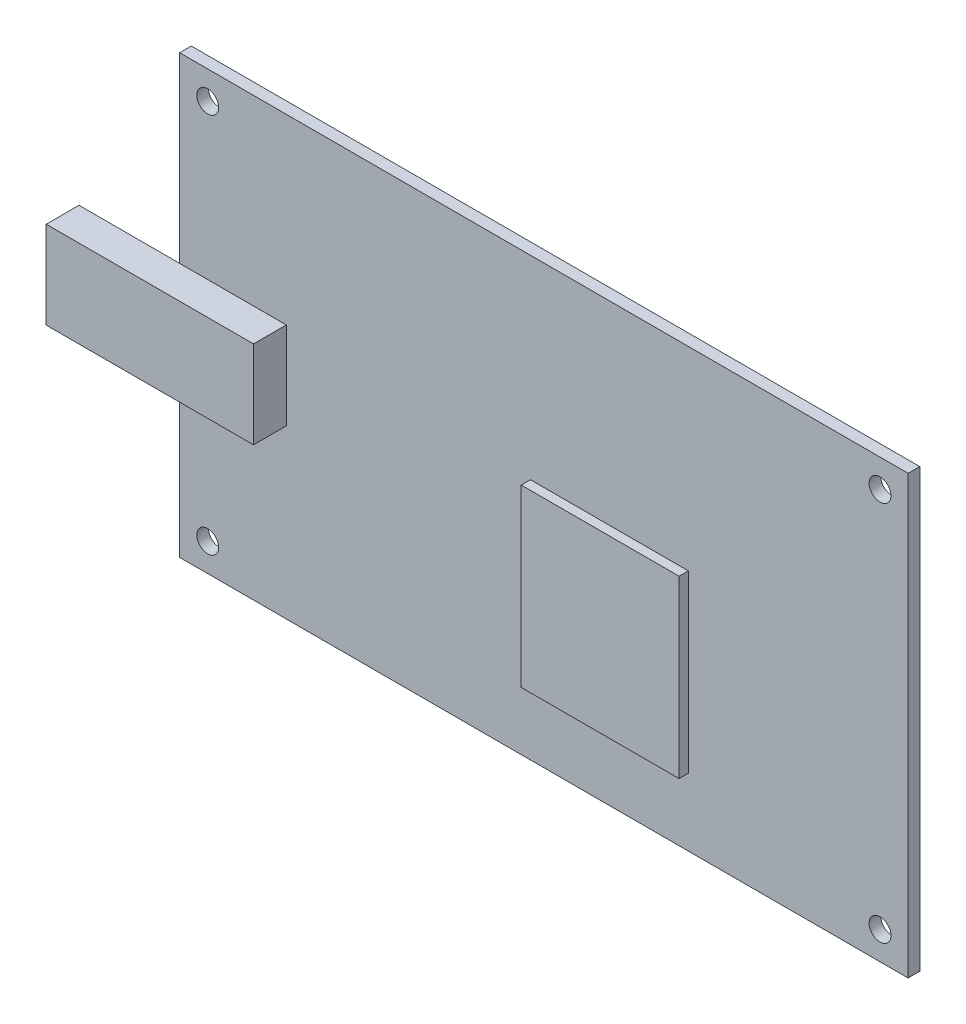
ISO-10303-21;
HEADER;
FILE_DESCRIPTION(('STEP AP214'),'2;1');
FILE_NAME('part.step','',(''),(''),'','','');
FILE_SCHEMA(('AUTOMOTIVE_DESIGN { 1 0 10303 214 1 1 1 1 }'));
ENDSEC;
DATA;
#1=APPLICATION_CONTEXT('core data for automotive mechanical design processes');
#2=APPLICATION_PROTOCOL_DEFINITION('international standard','automotive_design',2000,#1);
#3=PRODUCT_CONTEXT('',#1,'mechanical');
#4=PRODUCT('Part','Part','',(#3));
#5=PRODUCT_RELATED_PRODUCT_CATEGORY('part','',(#4));
#6=PRODUCT_DEFINITION_FORMATION('','',#4);
#7=PRODUCT_DEFINITION_CONTEXT('part definition',#1,'design');
#8=PRODUCT_DEFINITION('design','',#6,#7);
#9=PRODUCT_DEFINITION_SHAPE('','',#8);
#10=(LENGTH_UNIT() NAMED_UNIT(*) SI_UNIT(.MILLI.,.METRE.));
#11=(NAMED_UNIT(*) PLANE_ANGLE_UNIT() SI_UNIT($,.RADIAN.));
#12=(NAMED_UNIT(*) SI_UNIT($,.STERADIAN.) SOLID_ANGLE_UNIT());
#13=UNCERTAINTY_MEASURE_WITH_UNIT(LENGTH_MEASURE(1.E-05),#10,'distance_accuracy_value','');
#14=(GEOMETRIC_REPRESENTATION_CONTEXT(3) GLOBAL_UNCERTAINTY_ASSIGNED_CONTEXT((#13)) GLOBAL_UNIT_ASSIGNED_CONTEXT((#10,
#11,#12)) REPRESENTATION_CONTEXT('',''));
#15=CARTESIAN_POINT('',(0.,0.,0.));
#16=DIRECTION('',(0.,0.,1.));
#17=DIRECTION('',(1.,0.,0.));
#18=AXIS2_PLACEMENT_3D('',#15,#16,#17);
#19=CARTESIAN_POINT('',(0.,0.,1.6));
#20=DIRECTION('',(0.,0.,-1.));
#21=DIRECTION('',(-1.,0.,0.));
#22=AXIS2_PLACEMENT_3D('',#19,#20,#21);
#23=PLANE('',#22);
#24=CARTESIAN_POINT('',(-46.15,-26.15,1.6));
#25=DIRECTION('',(0.,0.,1.));
#26=DIRECTION('',(1.,0.,0.));
#27=AXIS2_PLACEMENT_3D('',#24,#25,#26);
#28=CIRCLE('',#27,1.5);
#29=CARTESIAN_POINT('',(-44.65,-26.15,1.6));
#30=VERTEX_POINT('',#29);
#31=EDGE_CURVE('E439',#30,#30,#28,.T.);
#32=ORIENTED_EDGE('',*,*,#31,.F.);
#33=EDGE_LOOP('',(#32));
#34=FACE_BOUND('',#33,.T.);
#35=CARTESIAN_POINT('',(-46.15,26.15,1.6));
#36=DIRECTION('',(0.,0.,1.));
#37=DIRECTION('',(1.,0.,0.));
#38=AXIS2_PLACEMENT_3D('',#35,#36,#37);
#39=CIRCLE('',#38,1.5);
#40=CARTESIAN_POINT('',(-44.65,26.15,1.6));
#41=VERTEX_POINT('',#40);
#42=EDGE_CURVE('E441',#41,#41,#39,.T.);
#43=ORIENTED_EDGE('',*,*,#42,.F.);
#44=EDGE_LOOP('',(#43));
#45=FACE_BOUND('',#44,.T.);
#46=CARTESIAN_POINT('',(46.15,-26.15,1.6));
#47=DIRECTION('',(0.,0.,1.));
#48=DIRECTION('',(1.,0.,0.));
#49=AXIS2_PLACEMENT_3D('',#46,#47,#48);
#50=CIRCLE('',#49,1.5);
#51=CARTESIAN_POINT('',(47.65,-26.15,1.6));
#52=VERTEX_POINT('',#51);
#53=EDGE_CURVE('E449',#52,#52,#50,.T.);
#54=ORIENTED_EDGE('',*,*,#53,.F.);
#55=EDGE_LOOP('',(#54));
#56=FACE_BOUND('',#55,.T.);
#57=CARTESIAN_POINT('',(46.15,26.15,1.6));
#58=DIRECTION('',(0.,0.,1.));
#59=DIRECTION('',(1.,0.,0.));
#60=AXIS2_PLACEMENT_3D('',#57,#58,#59);
#61=CIRCLE('',#60,1.5);
#62=CARTESIAN_POINT('',(47.65,26.15,1.6));
#63=VERTEX_POINT('',#62);
#64=EDGE_CURVE('E455',#63,#63,#61,.T.);
#65=ORIENTED_EDGE('',*,*,#64,.F.);
#66=EDGE_LOOP('',(#65));
#67=FACE_BOUND('',#66,.T.);
#68=DIRECTION('',(-1.,0.,0.));
#69=VECTOR('',#68,1.);
#70=CARTESIAN_POINT('',(-35.3638980427604,4.95599999999999,1.6));
#71=LINE('',#70,#69);
#72=CARTESIAN_POINT('',(-35.3638980427604,4.95599999999999,1.6));
#73=VERTEX_POINT('',#72);
#74=CARTESIAN_POINT('',(-50.,4.95599999999999,1.6));
#75=VERTEX_POINT('',#74);
#76=EDGE_CURVE('E167',#73,#75,#71,.T.);
#77=ORIENTED_EDGE('',*,*,#76,.F.);
#78=DIRECTION('',(0.,1.,0.));
#79=VECTOR('',#78,1.);
#80=CARTESIAN_POINT('',(-35.3638980427604,4.95599999999999,1.6));
#81=LINE('',#80,#79);
#82=CARTESIAN_POINT('',(-35.3638980427604,-7.04400000000001,1.6));
#83=VERTEX_POINT('',#82);
#84=EDGE_CURVE('E175',#83,#73,#81,.T.);
#85=ORIENTED_EDGE('',*,*,#84,.F.);
#86=DIRECTION('',(1.,0.,0.));
#87=VECTOR('',#86,1.);
#88=CARTESIAN_POINT('',(-35.3638980427604,-7.04400000000001,1.6));
#89=LINE('',#88,#87);
#90=CARTESIAN_POINT('',(-50.,-7.04400000000001,1.6));
#91=VERTEX_POINT('',#90);
#92=EDGE_CURVE('E11',#91,#83,#89,.T.);
#93=ORIENTED_EDGE('',*,*,#92,.F.);
#94=DIRECTION('',(0.,-1.,0.));
#95=VECTOR('',#94,1.);
#96=CARTESIAN_POINT('',(-50.,30.,1.6));
#97=LINE('',#96,#95);
#98=CARTESIAN_POINT('',(-50.,-30.,1.6));
#99=VERTEX_POINT('',#98);
#100=EDGE_CURVE('E200',#91,#99,#97,.T.);
#101=ORIENTED_EDGE('',*,*,#100,.T.);
#102=DIRECTION('',(-1.,0.,0.));
#103=VECTOR('',#102,1.);
#104=CARTESIAN_POINT('',(50.,-30.,1.6));
#105=LINE('',#104,#103);
#106=CARTESIAN_POINT('',(50.,-30.,1.6));
#107=VERTEX_POINT('',#106);
#108=EDGE_CURVE('E196',#107,#99,#105,.T.);
#109=ORIENTED_EDGE('',*,*,#108,.F.);
#110=DIRECTION('',(0.,-1.,0.));
#111=VECTOR('',#110,1.);
#112=CARTESIAN_POINT('',(50.,30.,1.6));
#113=LINE('',#112,#111);
#114=CARTESIAN_POINT('',(50.,30.,1.6));
#115=VERTEX_POINT('',#114);
#116=EDGE_CURVE('E193',#115,#107,#113,.T.);
#117=ORIENTED_EDGE('',*,*,#116,.F.);
#118=DIRECTION('',(-1.,0.,0.));
#119=VECTOR('',#118,1.);
#120=CARTESIAN_POINT('',(50.,30.,1.6));
#121=LINE('',#120,#119);
#122=CARTESIAN_POINT('',(-50.,30.,1.6));
#123=VERTEX_POINT('',#122);
#124=EDGE_CURVE('E204',#115,#123,#121,.T.);
#125=ORIENTED_EDGE('',*,*,#124,.T.);
#126=EDGE_CURVE('E201',#123,#75,#97,.T.);
#127=ORIENTED_EDGE('',*,*,#126,.T.);
#128=EDGE_LOOP('',(#77,#85,#93,#101,#109,#117,#125,#127));
#129=FACE_BOUND('',#128,.T.);
#130=DIRECTION('',(0.,-1.,0.));
#131=VECTOR('',#130,1.);
#132=CARTESIAN_POINT('',(-1.84094965071324,-20.7416611248163,1.6));
#133=LINE('',#132,#131);
#134=CARTESIAN_POINT('',(-1.84094965071324,3.31803456435864,1.6));
#135=VERTEX_POINT('',#134);
#136=CARTESIAN_POINT('',(-1.84094965071324,-20.7416611248163,1.6));
#137=VERTEX_POINT('',#136);
#138=EDGE_CURVE('E154',#135,#137,#133,.T.);
#139=ORIENTED_EDGE('',*,*,#138,.F.);
#140=DIRECTION('',(-1.,0.,0.));
#141=VECTOR('',#140,1.);
#142=CARTESIAN_POINT('',(19.8270936427463,3.31803456435864,1.6));
#143=LINE('',#142,#141);
#144=CARTESIAN_POINT('',(19.8270936427463,3.31803456435864,1.6));
#145=VERTEX_POINT('',#144);
#146=EDGE_CURVE('E151',#145,#135,#143,.T.);
#147=ORIENTED_EDGE('',*,*,#146,.F.);
#148=DIRECTION('',(0.,1.,0.));
#149=VECTOR('',#148,1.);
#150=CARTESIAN_POINT('',(19.8270936427463,-20.7416611248163,1.6));
#151=LINE('',#150,#149);
#152=CARTESIAN_POINT('',(19.8270936427463,-20.7416611248163,1.6));
#153=VERTEX_POINT('',#152);
#154=EDGE_CURVE('E59',#153,#145,#151,.T.);
#155=ORIENTED_EDGE('',*,*,#154,.F.);
#156=DIRECTION('',(1.,0.,0.));
#157=VECTOR('',#156,1.);
#158=CARTESIAN_POINT('',(19.8270936427463,-20.7416611248163,1.6));
#159=LINE('',#158,#157);
#160=EDGE_CURVE('E54',#137,#153,#159,.T.);
#161=ORIENTED_EDGE('',*,*,#160,.F.);
#162=EDGE_LOOP('',(#139,#147,#155,#161));
#163=FACE_BOUND('',#162,.T.);
#164=ADVANCED_FACE('F36',(#34,#45,#56,#67,#129,#163),#23,.F.);
#165=CARTESIAN_POINT('',(50.,30.,1.6));
#166=DIRECTION('',(1.,0.,0.));
#167=DIRECTION('',(0.,0.,-1.));
#168=AXIS2_PLACEMENT_3D('',#165,#166,#167);
#169=PLANE('',#168);
#170=DIRECTION('',(0.,-1.,0.));
#171=VECTOR('',#170,1.);
#172=CARTESIAN_POINT('',(50.,30.,0.));
#173=LINE('',#172,#171);
#174=CARTESIAN_POINT('',(50.,30.,0.));
#175=VERTEX_POINT('',#174);
#176=CARTESIAN_POINT('',(50.,-30.,0.));
#177=VERTEX_POINT('',#176);
#178=EDGE_CURVE('E192',#175,#177,#173,.T.);
#179=ORIENTED_EDGE('',*,*,#178,.F.);
#180=DIRECTION('',(0.,0.,-1.));
#181=VECTOR('',#180,1.);
#182=CARTESIAN_POINT('',(50.,30.,1.6));
#183=LINE('',#182,#181);
#184=EDGE_CURVE('E45',#115,#175,#183,.T.);
#185=ORIENTED_EDGE('',*,*,#184,.F.);
#186=ORIENTED_EDGE('',*,*,#116,.T.);
#187=DIRECTION('',(0.,0.,-1.));
#188=VECTOR('',#187,1.);
#189=CARTESIAN_POINT('',(50.,-30.,1.6));
#190=LINE('',#189,#188);
#191=EDGE_CURVE('E40',#107,#177,#190,.T.);
#192=ORIENTED_EDGE('',*,*,#191,.T.);
#193=EDGE_LOOP('',(#179,#185,#186,#192));
#194=FACE_BOUND('',#193,.T.);
#195=ADVANCED_FACE('F38',(#194),#169,.T.);
#196=CARTESIAN_POINT('',(50.,30.,1.6));
#197=DIRECTION('',(0.,-1.,0.));
#198=DIRECTION('',(1.,0.,0.));
#199=AXIS2_PLACEMENT_3D('',#196,#197,#198);
#200=PLANE('',#199);
#201=DIRECTION('',(-1.,0.,0.));
#202=VECTOR('',#201,1.);
#203=CARTESIAN_POINT('',(50.,30.,0.));
#204=LINE('',#203,#202);
#205=CARTESIAN_POINT('',(-50.,30.,0.));
#206=VERTEX_POINT('',#205);
#207=EDGE_CURVE('E197',#175,#206,#204,.T.);
#208=ORIENTED_EDGE('',*,*,#207,.T.);
#209=DIRECTION('',(0.,0.,-1.));
#210=VECTOR('',#209,1.);
#211=CARTESIAN_POINT('',(-50.,30.,1.6));
#212=LINE('',#211,#210);
#213=EDGE_CURVE('E217',#123,#206,#212,.T.);
#214=ORIENTED_EDGE('',*,*,#213,.F.);
#215=ORIENTED_EDGE('',*,*,#124,.F.);
#216=ORIENTED_EDGE('',*,*,#184,.T.);
#217=EDGE_LOOP('',(#208,#214,#215,#216));
#218=FACE_BOUND('',#217,.T.);
#219=ADVANCED_FACE('F234',(#218),#200,.F.);
#220=CARTESIAN_POINT('',(-50.,30.,1.6));
#221=DIRECTION('',(1.,0.,0.));
#222=DIRECTION('',(0.,0.,-1.));
#223=AXIS2_PLACEMENT_3D('',#220,#221,#222);
#224=PLANE('',#223);
#225=DIRECTION('',(0.,-1.,0.));
#226=VECTOR('',#225,1.);
#227=CARTESIAN_POINT('',(-50.,30.,0.));
#228=LINE('',#227,#226);
#229=CARTESIAN_POINT('',(-50.,-30.,0.));
#230=VERTEX_POINT('',#229);
#231=EDGE_CURVE('E212',#206,#230,#228,.T.);
#232=ORIENTED_EDGE('',*,*,#231,.T.);
#233=DIRECTION('',(0.,0.,-1.));
#234=VECTOR('',#233,1.);
#235=CARTESIAN_POINT('',(-50.,-30.,1.6));
#236=LINE('',#235,#234);
#237=EDGE_CURVE('E219',#99,#230,#236,.T.);
#238=ORIENTED_EDGE('',*,*,#237,.F.);
#239=ORIENTED_EDGE('',*,*,#100,.F.);
#240=EDGE_CURVE('E205',#75,#91,#97,.T.);
#241=ORIENTED_EDGE('',*,*,#240,.F.);
#242=ORIENTED_EDGE('',*,*,#126,.F.);
#243=ORIENTED_EDGE('',*,*,#213,.T.);
#244=EDGE_LOOP('',(#232,#238,#239,#241,#242,#243));
#245=FACE_BOUND('',#244,.T.);
#246=ADVANCED_FACE('F238',(#245),#224,.F.);
#247=CARTESIAN_POINT('',(50.,-30.,1.6));
#248=DIRECTION('',(0.,-1.,0.));
#249=DIRECTION('',(1.,0.,0.));
#250=AXIS2_PLACEMENT_3D('',#247,#248,#249);
#251=PLANE('',#250);
#252=DIRECTION('',(-1.,0.,0.));
#253=VECTOR('',#252,1.);
#254=CARTESIAN_POINT('',(50.,-30.,0.));
#255=LINE('',#254,#253);
#256=EDGE_CURVE('E209',#177,#230,#255,.T.);
#257=ORIENTED_EDGE('',*,*,#256,.F.);
#258=ORIENTED_EDGE('',*,*,#191,.F.);
#259=ORIENTED_EDGE('',*,*,#108,.T.);
#260=ORIENTED_EDGE('',*,*,#237,.T.);
#261=EDGE_LOOP('',(#257,#258,#259,#260));
#262=FACE_BOUND('',#261,.T.);
#263=ADVANCED_FACE('F227',(#262),#251,.T.);
#264=CARTESIAN_POINT('',(0.,0.,0.));
#265=DIRECTION('',(0.,0.,-1.));
#266=DIRECTION('',(-1.,0.,0.));
#267=AXIS2_PLACEMENT_3D('',#264,#265,#266);
#268=PLANE('',#267);
#269=CARTESIAN_POINT('',(-46.15,-26.15,0.));
#270=DIRECTION('',(0.,0.,-1.));
#271=DIRECTION('',(-1.,0.,0.));
#272=AXIS2_PLACEMENT_3D('',#269,#270,#271);
#273=CIRCLE('',#272,1.5);
#274=CARTESIAN_POINT('',(-47.65,-26.15,0.));
#275=VERTEX_POINT('',#274);
#276=EDGE_CURVE('E437',#275,#275,#273,.T.);
#277=ORIENTED_EDGE('',*,*,#276,.F.);
#278=EDGE_LOOP('',(#277));
#279=FACE_BOUND('',#278,.T.);
#280=CARTESIAN_POINT('',(-46.15,26.15,0.));
#281=DIRECTION('',(0.,0.,-1.));
#282=DIRECTION('',(-1.,0.,0.));
#283=AXIS2_PLACEMENT_3D('',#280,#281,#282);
#284=CIRCLE('',#283,1.5);
#285=CARTESIAN_POINT('',(-47.65,26.15,0.));
#286=VERTEX_POINT('',#285);
#287=EDGE_CURVE('E446',#286,#286,#284,.T.);
#288=ORIENTED_EDGE('',*,*,#287,.F.);
#289=EDGE_LOOP('',(#288));
#290=FACE_BOUND('',#289,.T.);
#291=CARTESIAN_POINT('',(46.15,-26.15,0.));
#292=DIRECTION('',(0.,0.,-1.));
#293=DIRECTION('',(-1.,0.,0.));
#294=AXIS2_PLACEMENT_3D('',#291,#292,#293);
#295=CIRCLE('',#294,1.5);
#296=CARTESIAN_POINT('',(44.65,-26.15,0.));
#297=VERTEX_POINT('',#296);
#298=EDGE_CURVE('E452',#297,#297,#295,.T.);
#299=ORIENTED_EDGE('',*,*,#298,.F.);
#300=EDGE_LOOP('',(#299));
#301=FACE_BOUND('',#300,.T.);
#302=CARTESIAN_POINT('',(46.15,26.15,0.));
#303=DIRECTION('',(0.,0.,-1.));
#304=DIRECTION('',(-1.,0.,0.));
#305=AXIS2_PLACEMENT_3D('',#302,#303,#304);
#306=CIRCLE('',#305,1.5);
#307=CARTESIAN_POINT('',(44.65,26.15,0.));
#308=VERTEX_POINT('',#307);
#309=EDGE_CURVE('E458',#308,#308,#306,.T.);
#310=ORIENTED_EDGE('',*,*,#309,.F.);
#311=EDGE_LOOP('',(#310));
#312=FACE_BOUND('',#311,.T.);
#313=ORIENTED_EDGE('',*,*,#178,.T.);
#314=ORIENTED_EDGE('',*,*,#256,.T.);
#315=ORIENTED_EDGE('',*,*,#231,.F.);
#316=ORIENTED_EDGE('',*,*,#207,.F.);
#317=EDGE_LOOP('',(#313,#314,#315,#316));
#318=FACE_BOUND('',#317,.T.);
#319=ADVANCED_FACE('F231',(#279,#290,#301,#312,#318),#268,.T.);
#320=CARTESIAN_POINT('',(-63.815805000047,4.95599999999999,6.1));
#321=DIRECTION('',(1.,0.,0.));
#322=DIRECTION('',(0.,0.,-1.));
#323=AXIS2_PLACEMENT_3D('',#320,#321,#322);
#324=PLANE('',#323);
#325=DIRECTION('',(0.,-1.,0.));
#326=VECTOR('',#325,1.);
#327=CARTESIAN_POINT('',(-63.815805000047,4.95599999999999,1.6));
#328=LINE('',#327,#326);
#329=CARTESIAN_POINT('',(-63.815805000047,4.95599999999999,1.6));
#330=VERTEX_POINT('',#329);
#331=CARTESIAN_POINT('',(-63.815805000047,-7.04400000000001,1.6));
#332=VERTEX_POINT('',#331);
#333=EDGE_CURVE('E155',#330,#332,#328,.T.);
#334=ORIENTED_EDGE('',*,*,#333,.T.);
#335=DIRECTION('',(0.,0.,-1.));
#336=VECTOR('',#335,1.);
#337=CARTESIAN_POINT('',(-63.815805000047,-7.04400000000001,6.1));
#338=LINE('',#337,#336);
#339=CARTESIAN_POINT('',(-63.815805000047,-7.04400000000001,6.1));
#340=VERTEX_POINT('',#339);
#341=EDGE_CURVE('E189',#340,#332,#338,.T.);
#342=ORIENTED_EDGE('',*,*,#341,.F.);
#343=DIRECTION('',(0.,-1.,0.));
#344=VECTOR('',#343,1.);
#345=CARTESIAN_POINT('',(-63.815805000047,4.95599999999999,6.1));
#346=LINE('',#345,#344);
#347=CARTESIAN_POINT('',(-63.815805000047,4.95599999999999,6.1));
#348=VERTEX_POINT('',#347);
#349=EDGE_CURVE('E163',#348,#340,#346,.T.);
#350=ORIENTED_EDGE('',*,*,#349,.F.);
#351=DIRECTION('',(0.,0.,-1.));
#352=VECTOR('',#351,1.);
#353=CARTESIAN_POINT('',(-63.815805000047,4.95599999999999,6.1));
#354=LINE('',#353,#352);
#355=EDGE_CURVE('E172',#348,#330,#354,.T.);
#356=ORIENTED_EDGE('',*,*,#355,.T.);
#357=EDGE_LOOP('',(#334,#342,#350,#356));
#358=FACE_BOUND('',#357,.T.);
#359=ADVANCED_FACE('F260',(#358),#324,.F.);
#360=CARTESIAN_POINT('',(-35.3638980427604,-7.04400000000001,6.1));
#361=DIRECTION('',(0.,1.,0.));
#362=DIRECTION('',(-1.,0.,0.));
#363=AXIS2_PLACEMENT_3D('',#360,#361,#362);
#364=PLANE('',#363);
#365=EDGE_CURVE('E47',#332,#91,#89,.T.);
#366=ORIENTED_EDGE('',*,*,#365,.T.);
#367=ORIENTED_EDGE('',*,*,#92,.T.);
#368=DIRECTION('',(0.,0.,-1.));
#369=VECTOR('',#368,1.);
#370=CARTESIAN_POINT('',(-35.3638980427604,-7.04400000000001,6.1));
#371=LINE('',#370,#369);
#372=CARTESIAN_POINT('',(-35.3638980427604,-7.04400000000001,6.1));
#373=VERTEX_POINT('',#372);
#374=EDGE_CURVE('E186',#373,#83,#371,.T.);
#375=ORIENTED_EDGE('',*,*,#374,.F.);
#376=DIRECTION('',(1.,0.,0.));
#377=VECTOR('',#376,1.);
#378=CARTESIAN_POINT('',(-35.3638980427604,-7.04400000000001,6.1));
#379=LINE('',#378,#377);
#380=EDGE_CURVE('E166',#340,#373,#379,.T.);
#381=ORIENTED_EDGE('',*,*,#380,.F.);
#382=ORIENTED_EDGE('',*,*,#341,.T.);
#383=EDGE_LOOP('',(#366,#367,#375,#381,#382));
#384=FACE_BOUND('',#383,.T.);
#385=ADVANCED_FACE('F256',(#384),#364,.F.);
#386=CARTESIAN_POINT('',(-35.3638980427604,4.95599999999999,6.1));
#387=DIRECTION('',(-1.,0.,0.));
#388=DIRECTION('',(0.,0.,1.));
#389=AXIS2_PLACEMENT_3D('',#386,#387,#388);
#390=PLANE('',#389);
#391=ORIENTED_EDGE('',*,*,#84,.T.);
#392=DIRECTION('',(0.,0.,-1.));
#393=VECTOR('',#392,1.);
#394=CARTESIAN_POINT('',(-35.3638980427604,4.95599999999999,6.1));
#395=LINE('',#394,#393);
#396=CARTESIAN_POINT('',(-35.3638980427604,4.95599999999999,6.1));
#397=VERTEX_POINT('',#396);
#398=EDGE_CURVE('E183',#397,#73,#395,.T.);
#399=ORIENTED_EDGE('',*,*,#398,.F.);
#400=DIRECTION('',(0.,1.,0.));
#401=VECTOR('',#400,1.);
#402=CARTESIAN_POINT('',(-35.3638980427604,4.95599999999999,6.1));
#403=LINE('',#402,#401);
#404=EDGE_CURVE('E169',#373,#397,#403,.T.);
#405=ORIENTED_EDGE('',*,*,#404,.F.);
#406=ORIENTED_EDGE('',*,*,#374,.T.);
#407=EDGE_LOOP('',(#391,#399,#405,#406));
#408=FACE_BOUND('',#407,.T.);
#409=ADVANCED_FACE('F253',(#408),#390,.F.);
#410=CARTESIAN_POINT('',(-35.3638980427604,4.95599999999999,6.1));
#411=DIRECTION('',(0.,-1.,0.));
#412=DIRECTION('',(1.,0.,0.));
#413=AXIS2_PLACEMENT_3D('',#410,#411,#412);
#414=PLANE('',#413);
#415=ORIENTED_EDGE('',*,*,#76,.T.);
#416=EDGE_CURVE('E178',#75,#330,#71,.T.);
#417=ORIENTED_EDGE('',*,*,#416,.T.);
#418=ORIENTED_EDGE('',*,*,#355,.F.);
#419=DIRECTION('',(-1.,0.,0.));
#420=VECTOR('',#419,1.);
#421=CARTESIAN_POINT('',(-35.3638980427604,4.95599999999999,6.1));
#422=LINE('',#421,#420);
#423=EDGE_CURVE('E171',#397,#348,#422,.T.);
#424=ORIENTED_EDGE('',*,*,#423,.F.);
#425=ORIENTED_EDGE('',*,*,#398,.T.);
#426=EDGE_LOOP('',(#415,#417,#418,#424,#425));
#427=FACE_BOUND('',#426,.T.);
#428=ADVANCED_FACE('F248',(#427),#414,.F.);
#429=CARTESIAN_POINT('',(0.,0.,6.1));
#430=DIRECTION('',(0.,0.,-1.));
#431=DIRECTION('',(-1.,0.,0.));
#432=AXIS2_PLACEMENT_3D('',#429,#430,#431);
#433=PLANE('',#432);
#434=ORIENTED_EDGE('',*,*,#349,.T.);
#435=ORIENTED_EDGE('',*,*,#380,.T.);
#436=ORIENTED_EDGE('',*,*,#404,.T.);
#437=ORIENTED_EDGE('',*,*,#423,.T.);
#438=EDGE_LOOP('',(#434,#435,#436,#437));
#439=FACE_BOUND('',#438,.T.);
#440=ADVANCED_FACE('F262',(#439),#433,.F.);
#441=CARTESIAN_POINT('',(0.,0.,1.6));
#442=DIRECTION('',(0.,0.,-1.));
#443=DIRECTION('',(-1.,0.,0.));
#444=AXIS2_PLACEMENT_3D('',#441,#442,#443);
#445=PLANE('',#444);
#446=ORIENTED_EDGE('',*,*,#416,.F.);
#447=ORIENTED_EDGE('',*,*,#240,.T.);
#448=ORIENTED_EDGE('',*,*,#365,.F.);
#449=ORIENTED_EDGE('',*,*,#333,.F.);
#450=EDGE_LOOP('',(#446,#447,#448,#449));
#451=FACE_BOUND('',#450,.T.);
#452=ADVANCED_FACE('F245',(#451),#445,.T.);
#453=CARTESIAN_POINT('',(-1.84094965071324,-20.7416611248163,2.87));
#454=DIRECTION('',(1.,0.,0.));
#455=DIRECTION('',(0.,0.,-1.));
#456=AXIS2_PLACEMENT_3D('',#453,#454,#455);
#457=PLANE('',#456);
#458=ORIENTED_EDGE('',*,*,#138,.T.);
#459=DIRECTION('',(0.,0.,-1.));
#460=VECTOR('',#459,1.);
#461=CARTESIAN_POINT('',(-1.84094965071324,-20.7416611248163,2.87));
#462=LINE('',#461,#460);
#463=CARTESIAN_POINT('',(-1.84094965071324,-20.7416611248163,2.87));
#464=VERTEX_POINT('',#463);
#465=EDGE_CURVE('E135',#464,#137,#462,.T.);
#466=ORIENTED_EDGE('',*,*,#465,.F.);
#467=DIRECTION('',(0.,-1.,0.));
#468=VECTOR('',#467,1.);
#469=CARTESIAN_POINT('',(-1.84094965071324,-20.7416611248163,2.87));
#470=LINE('',#469,#468);
#471=CARTESIAN_POINT('',(-1.84094965071324,3.31803456435864,2.87));
#472=VERTEX_POINT('',#471);
#473=EDGE_CURVE('E142',#472,#464,#470,.T.);
#474=ORIENTED_EDGE('',*,*,#473,.F.);
#475=DIRECTION('',(0.,0.,-1.));
#476=VECTOR('',#475,1.);
#477=CARTESIAN_POINT('',(-1.84094965071324,3.31803456435864,2.87));
#478=LINE('',#477,#476);
#479=EDGE_CURVE('E463',#472,#135,#478,.T.);
#480=ORIENTED_EDGE('',*,*,#479,.T.);
#481=EDGE_LOOP('',(#458,#466,#474,#480));
#482=FACE_BOUND('',#481,.T.);
#483=ADVANCED_FACE('F153',(#482),#457,.F.);
#484=CARTESIAN_POINT('',(19.8270936427463,-20.7416611248163,2.87));
#485=DIRECTION('',(0.,1.,0.));
#486=DIRECTION('',(0.,0.,1.));
#487=AXIS2_PLACEMENT_3D('',#484,#485,#486);
#488=PLANE('',#487);
#489=ORIENTED_EDGE('',*,*,#160,.T.);
#490=DIRECTION('',(0.,0.,-1.));
#491=VECTOR('',#490,1.);
#492=CARTESIAN_POINT('',(19.8270936427463,-20.7416611248163,2.87));
#493=LINE('',#492,#491);
#494=CARTESIAN_POINT('',(19.8270936427463,-20.7416611248163,2.87));
#495=VERTEX_POINT('',#494);
#496=EDGE_CURVE('E138',#495,#153,#493,.T.);
#497=ORIENTED_EDGE('',*,*,#496,.F.);
#498=DIRECTION('',(1.,0.,0.));
#499=VECTOR('',#498,1.);
#500=CARTESIAN_POINT('',(19.8270936427463,-20.7416611248163,2.87));
#501=LINE('',#500,#499);
#502=EDGE_CURVE('E131',#464,#495,#501,.T.);
#503=ORIENTED_EDGE('',*,*,#502,.F.);
#504=ORIENTED_EDGE('',*,*,#465,.T.);
#505=EDGE_LOOP('',(#489,#497,#503,#504));
#506=FACE_BOUND('',#505,.T.);
#507=ADVANCED_FACE('F133',(#506),#488,.F.);
#508=CARTESIAN_POINT('',(19.8270936427463,-20.7416611248163,2.87));
#509=DIRECTION('',(-1.,0.,0.));
#510=DIRECTION('',(0.,0.,1.));
#511=AXIS2_PLACEMENT_3D('',#508,#509,#510);
#512=PLANE('',#511);
#513=ORIENTED_EDGE('',*,*,#154,.T.);
#514=DIRECTION('',(0.,0.,-1.));
#515=VECTOR('',#514,1.);
#516=CARTESIAN_POINT('',(19.8270936427463,3.31803456435864,2.87));
#517=LINE('',#516,#515);
#518=CARTESIAN_POINT('',(19.8270936427463,3.31803456435864,2.87));
#519=VERTEX_POINT('',#518);
#520=EDGE_CURVE('E159',#519,#145,#517,.T.);
#521=ORIENTED_EDGE('',*,*,#520,.F.);
#522=DIRECTION('',(0.,1.,0.));
#523=VECTOR('',#522,1.);
#524=CARTESIAN_POINT('',(19.8270936427463,-20.7416611248163,2.87));
#525=LINE('',#524,#523);
#526=EDGE_CURVE('E141',#495,#519,#525,.T.);
#527=ORIENTED_EDGE('',*,*,#526,.F.);
#528=ORIENTED_EDGE('',*,*,#496,.T.);
#529=EDGE_LOOP('',(#513,#521,#527,#528));
#530=FACE_BOUND('',#529,.T.);
#531=ADVANCED_FACE('F358',(#530),#512,.F.);
#532=CARTESIAN_POINT('',(19.8270936427463,3.31803456435864,2.87));
#533=DIRECTION('',(0.,-1.,0.));
#534=DIRECTION('',(0.,0.,-1.));
#535=AXIS2_PLACEMENT_3D('',#532,#533,#534);
#536=PLANE('',#535);
#537=ORIENTED_EDGE('',*,*,#146,.T.);
#538=ORIENTED_EDGE('',*,*,#479,.F.);
#539=DIRECTION('',(-1.,0.,0.));
#540=VECTOR('',#539,1.);
#541=CARTESIAN_POINT('',(19.8270936427463,3.31803456435864,2.87));
#542=LINE('',#541,#540);
#543=EDGE_CURVE('E147',#519,#472,#542,.T.);
#544=ORIENTED_EDGE('',*,*,#543,.F.);
#545=ORIENTED_EDGE('',*,*,#520,.T.);
#546=EDGE_LOOP('',(#537,#538,#544,#545));
#547=FACE_BOUND('',#546,.T.);
#548=ADVANCED_FACE('F368',(#547),#536,.F.);
#549=CARTESIAN_POINT('',(0.,0.,2.87));
#550=DIRECTION('',(0.,0.,1.));
#551=DIRECTION('',(1.,0.,0.));
#552=AXIS2_PLACEMENT_3D('',#549,#550,#551);
#553=PLANE('',#552);
#554=ORIENTED_EDGE('',*,*,#473,.T.);
#555=ORIENTED_EDGE('',*,*,#502,.T.);
#556=ORIENTED_EDGE('',*,*,#526,.T.);
#557=ORIENTED_EDGE('',*,*,#543,.T.);
#558=EDGE_LOOP('',(#554,#555,#556,#557));
#559=FACE_BOUND('',#558,.T.);
#560=ADVANCED_FACE('F145',(#559),#553,.T.);
#561=CARTESIAN_POINT('',(46.15,26.15,1.6));
#562=DIRECTION('',(0.,0.,1.));
#563=DIRECTION('',(1.,0.,0.));
#564=AXIS2_PLACEMENT_3D('',#561,#562,#563);
#565=CYLINDRICAL_SURFACE('',#564,1.5);
#566=ORIENTED_EDGE('',*,*,#309,.T.);
#567=EDGE_LOOP('',(#566));
#568=FACE_BOUND('',#567,.T.);
#569=ORIENTED_EDGE('',*,*,#64,.T.);
#570=EDGE_LOOP('',(#569));
#571=FACE_BOUND('',#570,.T.);
#572=ADVANCED_FACE('F386',(#568,#571),#565,.F.);
#573=CARTESIAN_POINT('',(46.15,-26.15,1.6));
#574=DIRECTION('',(0.,0.,1.));
#575=DIRECTION('',(1.,0.,0.));
#576=AXIS2_PLACEMENT_3D('',#573,#574,#575);
#577=CYLINDRICAL_SURFACE('',#576,1.5);
#578=ORIENTED_EDGE('',*,*,#298,.T.);
#579=EDGE_LOOP('',(#578));
#580=FACE_BOUND('',#579,.T.);
#581=ORIENTED_EDGE('',*,*,#53,.T.);
#582=EDGE_LOOP('',(#581));
#583=FACE_BOUND('',#582,.T.);
#584=ADVANCED_FACE('F400',(#580,#583),#577,.F.);
#585=CARTESIAN_POINT('',(-46.15,26.15,1.6));
#586=DIRECTION('',(0.,0.,1.));
#587=DIRECTION('',(1.,0.,0.));
#588=AXIS2_PLACEMENT_3D('',#585,#586,#587);
#589=CYLINDRICAL_SURFACE('',#588,1.5);
#590=ORIENTED_EDGE('',*,*,#287,.T.);
#591=EDGE_LOOP('',(#590));
#592=FACE_BOUND('',#591,.T.);
#593=ORIENTED_EDGE('',*,*,#42,.T.);
#594=EDGE_LOOP('',(#593));
#595=FACE_BOUND('',#594,.T.);
#596=ADVANCED_FACE('F407',(#592,#595),#589,.F.);
#597=CARTESIAN_POINT('',(-46.15,-26.15,1.6));
#598=DIRECTION('',(0.,0.,1.));
#599=DIRECTION('',(1.,0.,0.));
#600=AXIS2_PLACEMENT_3D('',#597,#598,#599);
#601=CYLINDRICAL_SURFACE('',#600,1.5);
#602=ORIENTED_EDGE('',*,*,#276,.T.);
#603=EDGE_LOOP('',(#602));
#604=FACE_BOUND('',#603,.T.);
#605=ORIENTED_EDGE('',*,*,#31,.T.);
#606=EDGE_LOOP('',(#605));
#607=FACE_BOUND('',#606,.T.);
#608=ADVANCED_FACE('F415',(#604,#607),#601,.F.);
#609=CLOSED_SHELL('',(#164,#195,#219,#246,#263,#319,#359,#385,#409,#428,#440,#452,#483,#507,
#531,#548,#560,#572,#584,#596,#608));
#610=MANIFOLD_SOLID_BREP('B2',#609);
#611=ADVANCED_BREP_SHAPE_REPRESENTATION('',(#18,#610),#14);
#612=SHAPE_DEFINITION_REPRESENTATION(#9,#611);
ENDSEC;
END-ISO-10303-21;
